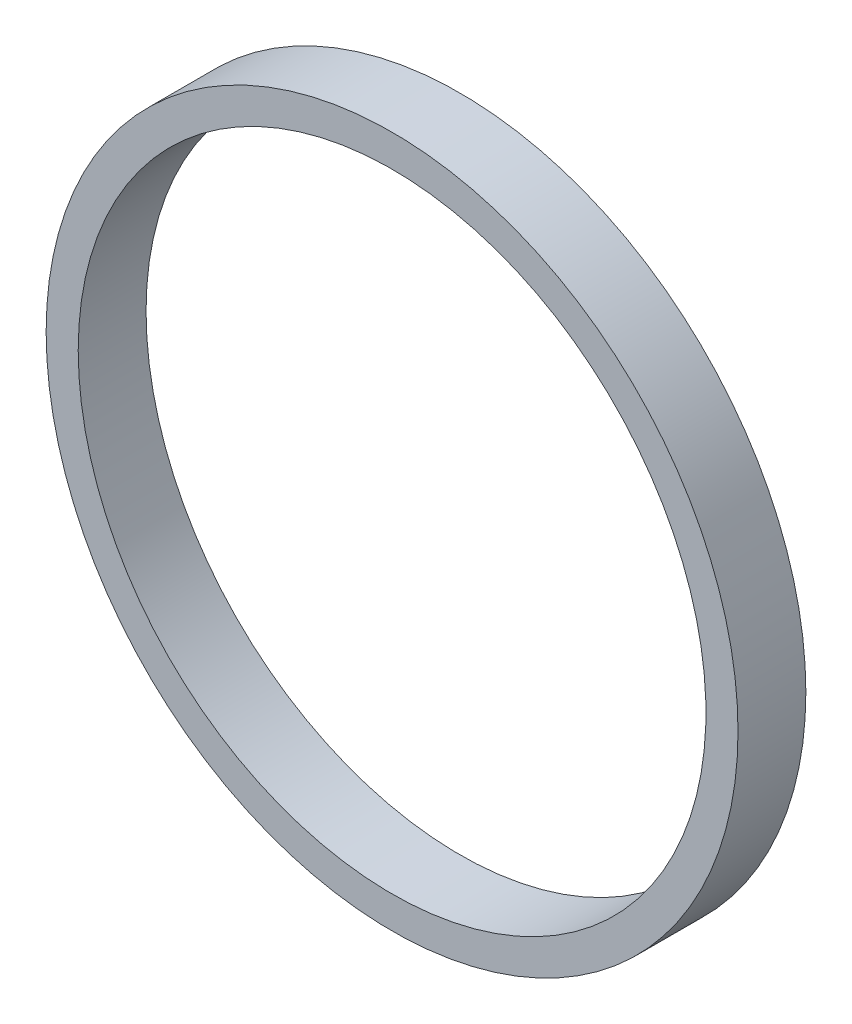
ISO-10303-21;
HEADER;
FILE_DESCRIPTION(('STEP AP214'),'2;1');
FILE_NAME('part.step','',(''),(''),'','','');
FILE_SCHEMA(('AUTOMOTIVE_DESIGN { 1 0 10303 214 1 1 1 1 }'));
ENDSEC;
DATA;
#1=APPLICATION_CONTEXT('core data for automotive mechanical design processes');
#2=APPLICATION_PROTOCOL_DEFINITION('international standard','automotive_design',2000,#1);
#3=PRODUCT_CONTEXT('',#1,'mechanical');
#4=PRODUCT('Part','Part','',(#3));
#5=PRODUCT_RELATED_PRODUCT_CATEGORY('part','',(#4));
#6=PRODUCT_DEFINITION_FORMATION('','',#4);
#7=PRODUCT_DEFINITION_CONTEXT('part definition',#1,'design');
#8=PRODUCT_DEFINITION('design','',#6,#7);
#9=PRODUCT_DEFINITION_SHAPE('','',#8);
#10=(LENGTH_UNIT() NAMED_UNIT(*) SI_UNIT(.MILLI.,.METRE.));
#11=(NAMED_UNIT(*) PLANE_ANGLE_UNIT() SI_UNIT($,.RADIAN.));
#12=(NAMED_UNIT(*) SI_UNIT($,.STERADIAN.) SOLID_ANGLE_UNIT());
#13=UNCERTAINTY_MEASURE_WITH_UNIT(LENGTH_MEASURE(1.E-05),#10,'distance_accuracy_value','');
#14=(GEOMETRIC_REPRESENTATION_CONTEXT(3) GLOBAL_UNCERTAINTY_ASSIGNED_CONTEXT((#13)) GLOBAL_UNIT_ASSIGNED_CONTEXT((#10,
#11,#12)) REPRESENTATION_CONTEXT('',''));
#15=CARTESIAN_POINT('',(0.,0.,0.));
#16=DIRECTION('',(0.,0.,1.));
#17=DIRECTION('',(1.,0.,0.));
#18=AXIS2_PLACEMENT_3D('',#15,#16,#17);
#19=CARTESIAN_POINT('',(40.,16.,9.68));
#20=DIRECTION('',(0.,0.,-1.));
#21=DIRECTION('',(-1.,0.,0.));
#22=AXIS2_PLACEMENT_3D('',#19,#20,#21);
#23=CYLINDRICAL_SURFACE('',#22,5.8751784);
#24=CARTESIAN_POINT('',(40.,16.,10.95));
#25=DIRECTION('',(0.,0.,-1.));
#26=DIRECTION('',(-1.,0.,0.));
#27=AXIS2_PLACEMENT_3D('',#24,#25,#26);
#28=CIRCLE('',#27,5.8751784);
#29=CARTESIAN_POINT('',(34.1248216,16.,10.95));
#30=VERTEX_POINT('',#29);
#31=EDGE_CURVE('E27',#30,#30,#28,.T.);
#32=ORIENTED_EDGE('',*,*,#31,.F.);
#33=EDGE_LOOP('',(#32));
#34=FACE_BOUND('',#33,.T.);
#35=CARTESIAN_POINT('',(40.,16.,9.68));
#36=DIRECTION('',(0.,0.,-1.));
#37=DIRECTION('',(-1.,0.,0.));
#38=AXIS2_PLACEMENT_3D('',#35,#36,#37);
#39=CIRCLE('',#38,5.8751784);
#40=CARTESIAN_POINT('',(34.1248216,16.,9.68));
#41=VERTEX_POINT('',#40);
#42=EDGE_CURVE('E18',#41,#41,#39,.T.);
#43=ORIENTED_EDGE('',*,*,#42,.T.);
#44=EDGE_LOOP('',(#43));
#45=FACE_BOUND('',#44,.T.);
#46=ADVANCED_FACE('F15',(#34,#45),#23,.F.);
#47=CARTESIAN_POINT('',(27.99999999999,16.000000000005,9.68));
#48=DIRECTION('',(0.,0.,1.));
#49=DIRECTION('',(1.,0.,0.));
#50=AXIS2_PLACEMENT_3D('',#47,#48,#49);
#51=PLANE('',#50);
#52=CARTESIAN_POINT('',(40.,16.,9.68));
#53=DIRECTION('',(0.,0.,-1.));
#54=DIRECTION('',(-1.,0.,0.));
#55=AXIS2_PLACEMENT_3D('',#52,#53,#54);
#56=CIRCLE('',#55,6.4754378);
#57=CARTESIAN_POINT('',(33.5245622,16.,9.68));
#58=VERTEX_POINT('',#57);
#59=EDGE_CURVE('E22',#58,#58,#56,.F.);
#60=ORIENTED_EDGE('',*,*,#59,.F.);
#61=EDGE_LOOP('',(#60));
#62=FACE_BOUND('',#61,.T.);
#63=ORIENTED_EDGE('',*,*,#42,.F.);
#64=EDGE_LOOP('',(#63));
#65=FACE_BOUND('',#64,.T.);
#66=ADVANCED_FACE('F36',(#62,#65),#51,.F.);
#67=CARTESIAN_POINT('',(27.99999999999,16.000000000005,10.95));
#68=DIRECTION('',(0.,0.,1.));
#69=DIRECTION('',(1.,0.,0.));
#70=AXIS2_PLACEMENT_3D('',#67,#68,#69);
#71=PLANE('',#70);
#72=CARTESIAN_POINT('',(40.,16.,10.95));
#73=DIRECTION('',(0.,0.,-1.));
#74=DIRECTION('',(-1.,0.,0.));
#75=AXIS2_PLACEMENT_3D('',#72,#73,#74);
#76=CIRCLE('',#75,6.4754378);
#77=CARTESIAN_POINT('',(33.5245622,16.,10.95));
#78=VERTEX_POINT('',#77);
#79=EDGE_CURVE('E10',#78,#78,#76,.T.);
#80=ORIENTED_EDGE('',*,*,#79,.F.);
#81=EDGE_LOOP('',(#80));
#82=FACE_BOUND('',#81,.T.);
#83=ORIENTED_EDGE('',*,*,#31,.T.);
#84=EDGE_LOOP('',(#83));
#85=FACE_BOUND('',#84,.T.);
#86=ADVANCED_FACE('F38',(#82,#85),#71,.T.);
#87=CARTESIAN_POINT('',(40.,16.,9.68));
#88=DIRECTION('',(0.,0.,-1.));
#89=DIRECTION('',(-1.,0.,0.));
#90=AXIS2_PLACEMENT_3D('',#87,#88,#89);
#91=CYLINDRICAL_SURFACE('',#90,6.4754378);
#92=ORIENTED_EDGE('',*,*,#79,.T.);
#93=EDGE_LOOP('',(#92));
#94=FACE_BOUND('',#93,.T.);
#95=ORIENTED_EDGE('',*,*,#59,.T.);
#96=EDGE_LOOP('',(#95));
#97=FACE_BOUND('',#96,.T.);
#98=ADVANCED_FACE('F45',(#94,#97),#91,.T.);
#99=CLOSED_SHELL('',(#46,#66,#86,#98));
#100=MANIFOLD_SOLID_BREP('B1',#99);
#101=ADVANCED_BREP_SHAPE_REPRESENTATION('',(#18,#100),#14);
#102=SHAPE_DEFINITION_REPRESENTATION(#9,#101);
ENDSEC;
END-ISO-10303-21;
